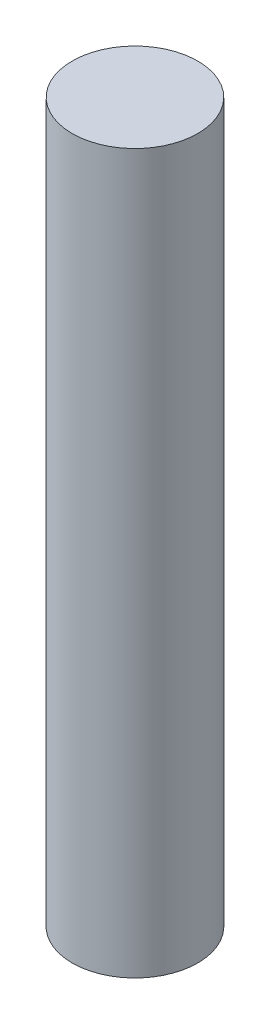
ISO-10303-21;
HEADER;
FILE_DESCRIPTION(('STEP AP214'),'2;1');
FILE_NAME('part.step','',(''),(''),'','','');
FILE_SCHEMA(('AUTOMOTIVE_DESIGN { 1 0 10303 214 1 1 1 1 }'));
ENDSEC;
DATA;
#1=APPLICATION_CONTEXT('core data for automotive mechanical design processes');
#2=APPLICATION_PROTOCOL_DEFINITION('international standard','automotive_design',2000,#1);
#3=PRODUCT_CONTEXT('',#1,'mechanical');
#4=PRODUCT('Part','Part','',(#3));
#5=PRODUCT_RELATED_PRODUCT_CATEGORY('part','',(#4));
#6=PRODUCT_DEFINITION_FORMATION('','',#4);
#7=PRODUCT_DEFINITION_CONTEXT('part definition',#1,'design');
#8=PRODUCT_DEFINITION('design','',#6,#7);
#9=PRODUCT_DEFINITION_SHAPE('','',#8);
#10=(LENGTH_UNIT() NAMED_UNIT(*) SI_UNIT(.MILLI.,.METRE.));
#11=(NAMED_UNIT(*) PLANE_ANGLE_UNIT() SI_UNIT($,.RADIAN.));
#12=(NAMED_UNIT(*) SI_UNIT($,.STERADIAN.) SOLID_ANGLE_UNIT());
#13=UNCERTAINTY_MEASURE_WITH_UNIT(LENGTH_MEASURE(1.E-05),#10,'distance_accuracy_value','');
#14=(GEOMETRIC_REPRESENTATION_CONTEXT(3) GLOBAL_UNCERTAINTY_ASSIGNED_CONTEXT((#13)) GLOBAL_UNIT_ASSIGNED_CONTEXT((#10,
#11,#12)) REPRESENTATION_CONTEXT('',''));
#15=CARTESIAN_POINT('',(0.,0.,0.));
#16=DIRECTION('',(0.,0.,1.));
#17=DIRECTION('',(1.,0.,0.));
#18=AXIS2_PLACEMENT_3D('',#15,#16,#17);
#19=CARTESIAN_POINT('',(0.,75.,0.));
#20=DIRECTION('',(0.,-1.,0.));
#21=DIRECTION('',(0.,0.,-1.));
#22=AXIS2_PLACEMENT_3D('',#19,#20,#21);
#23=CYLINDRICAL_SURFACE('',#22,13.115);
#24=CARTESIAN_POINT('',(0.,75.,0.));
#25=DIRECTION('',(0.,1.,0.));
#26=DIRECTION('',(0.,0.,1.));
#27=AXIS2_PLACEMENT_3D('',#24,#25,#26);
#28=CIRCLE('',#27,13.115);
#29=CARTESIAN_POINT('',(0.,75.,13.115));
#30=VERTEX_POINT('',#29);
#31=EDGE_CURVE('E10',#30,#30,#28,.T.);
#32=ORIENTED_EDGE('',*,*,#31,.F.);
#33=EDGE_LOOP('',(#32));
#34=FACE_BOUND('',#33,.T.);
#35=CARTESIAN_POINT('',(0.,-75.,0.));
#36=DIRECTION('',(0.,1.,0.));
#37=DIRECTION('',(0.,0.,1.));
#38=AXIS2_PLACEMENT_3D('',#35,#36,#37);
#39=CIRCLE('',#38,13.115);
#40=CARTESIAN_POINT('',(0.,-75.,13.115));
#41=VERTEX_POINT('',#40);
#42=EDGE_CURVE('E38',#41,#41,#39,.T.);
#43=ORIENTED_EDGE('',*,*,#42,.T.);
#44=EDGE_LOOP('',(#43));
#45=FACE_BOUND('',#44,.T.);
#46=ADVANCED_FACE('F35',(#34,#45),#23,.T.);
#47=CARTESIAN_POINT('',(0.,75.,0.));
#48=DIRECTION('',(0.,1.,0.));
#49=DIRECTION('',(0.,0.,1.));
#50=AXIS2_PLACEMENT_3D('',#47,#48,#49);
#51=PLANE('',#50);
#52=ORIENTED_EDGE('',*,*,#31,.T.);
#53=EDGE_LOOP('',(#52));
#54=FACE_BOUND('',#53,.T.);
#55=ADVANCED_FACE('F50',(#54),#51,.T.);
#56=CARTESIAN_POINT('',(0.,-75.,0.));
#57=DIRECTION('',(0.,1.,0.));
#58=DIRECTION('',(0.,0.,1.));
#59=AXIS2_PLACEMENT_3D('',#56,#57,#58);
#60=PLANE('',#59);
#61=ORIENTED_EDGE('',*,*,#42,.F.);
#62=EDGE_LOOP('',(#61));
#63=FACE_BOUND('',#62,.T.);
#64=ADVANCED_FACE('F48',(#63),#60,.F.);
#65=CLOSED_SHELL('',(#46,#55,#64));
#66=MANIFOLD_SOLID_BREP('B2',#65);
#67=ADVANCED_BREP_SHAPE_REPRESENTATION('',(#18,#66),#14);
#68=SHAPE_DEFINITION_REPRESENTATION(#9,#67);
ENDSEC;
END-ISO-10303-21;
